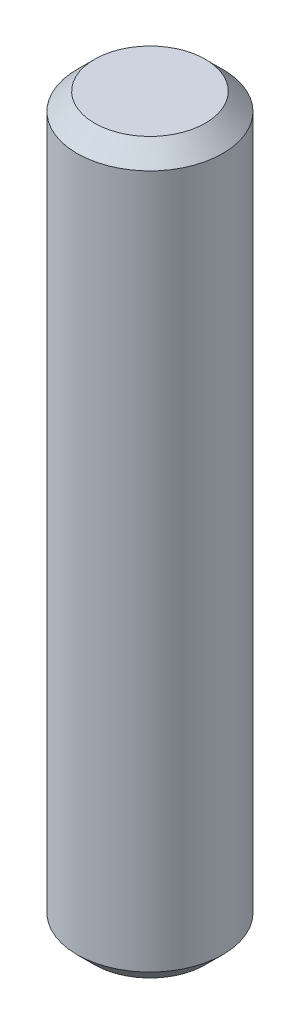
ISO-10303-21;
HEADER;
FILE_DESCRIPTION(('STEP AP214'),'2;1');
FILE_NAME('part.step','',(''),(''),'','','');
FILE_SCHEMA(('AUTOMOTIVE_DESIGN { 1 0 10303 214 1 1 1 1 }'));
ENDSEC;
DATA;
#1=APPLICATION_CONTEXT('core data for automotive mechanical design processes');
#2=APPLICATION_PROTOCOL_DEFINITION('international standard','automotive_design',2000,#1);
#3=PRODUCT_CONTEXT('',#1,'mechanical');
#4=PRODUCT('Part','Part','',(#3));
#5=PRODUCT_RELATED_PRODUCT_CATEGORY('part','',(#4));
#6=PRODUCT_DEFINITION_FORMATION('','',#4);
#7=PRODUCT_DEFINITION_CONTEXT('part definition',#1,'design');
#8=PRODUCT_DEFINITION('design','',#6,#7);
#9=PRODUCT_DEFINITION_SHAPE('','',#8);
#10=(LENGTH_UNIT() NAMED_UNIT(*) SI_UNIT(.MILLI.,.METRE.));
#11=(NAMED_UNIT(*) PLANE_ANGLE_UNIT() SI_UNIT($,.RADIAN.));
#12=(NAMED_UNIT(*) SI_UNIT($,.STERADIAN.) SOLID_ANGLE_UNIT());
#13=UNCERTAINTY_MEASURE_WITH_UNIT(LENGTH_MEASURE(1.E-05),#10,'distance_accuracy_value','');
#14=(GEOMETRIC_REPRESENTATION_CONTEXT(3) GLOBAL_UNCERTAINTY_ASSIGNED_CONTEXT((#13)) GLOBAL_UNIT_ASSIGNED_CONTEXT((#10,
#11,#12)) REPRESENTATION_CONTEXT('',''));
#15=CARTESIAN_POINT('',(0.,0.,0.));
#16=DIRECTION('',(0.,0.,1.));
#17=DIRECTION('',(1.,0.,0.));
#18=AXIS2_PLACEMENT_3D('',#15,#16,#17);
#19=CARTESIAN_POINT('',(0.,31.75,0.));
#20=DIRECTION('',(0.,-1.,0.));
#21=DIRECTION('',(0.,0.,-1.));
#22=AXIS2_PLACEMENT_3D('',#19,#20,#21);
#23=CYLINDRICAL_SURFACE('',#22,6.35);
#24=CARTESIAN_POINT('',(0.,-30.226,0.));
#25=DIRECTION('',(0.,1.,0.));
#26=DIRECTION('',(0.,0.,1.));
#27=AXIS2_PLACEMENT_3D('',#24,#25,#26);
#28=CIRCLE('',#27,6.35);
#29=CARTESIAN_POINT('',(0.,-30.226,6.35));
#30=VERTEX_POINT('',#29);
#31=EDGE_CURVE('E43',#30,#30,#28,.T.);
#32=ORIENTED_EDGE('',*,*,#31,.T.);
#33=EDGE_LOOP('',(#32));
#34=FACE_BOUND('',#33,.T.);
#35=CARTESIAN_POINT('',(0.,30.226,0.));
#36=DIRECTION('',(0.,1.,0.));
#37=DIRECTION('',(0.,0.,1.));
#38=AXIS2_PLACEMENT_3D('',#35,#36,#37);
#39=CIRCLE('',#38,6.35);
#40=CARTESIAN_POINT('',(0.,30.226,6.35));
#41=VERTEX_POINT('',#40);
#42=EDGE_CURVE('E47',#41,#41,#39,.F.);
#43=ORIENTED_EDGE('',*,*,#42,.T.);
#44=EDGE_LOOP('',(#43));
#45=FACE_BOUND('',#44,.T.);
#46=ADVANCED_FACE('F32',(#34,#45),#23,.T.);
#47=CARTESIAN_POINT('',(0.,31.75,0.));
#48=DIRECTION('',(0.,1.,0.));
#49=DIRECTION('',(0.,0.,1.));
#50=AXIS2_PLACEMENT_3D('',#47,#48,#49);
#51=PLANE('',#50);
#52=CARTESIAN_POINT('',(0.,31.75,0.));
#53=DIRECTION('',(0.,1.,0.));
#54=DIRECTION('',(0.,0.,1.));
#55=AXIS2_PLACEMENT_3D('',#52,#53,#54);
#56=CIRCLE('',#55,4.826);
#57=CARTESIAN_POINT('',(0.,31.75,4.826));
#58=VERTEX_POINT('',#57);
#59=EDGE_CURVE('E10',#58,#58,#56,.T.);
#60=ORIENTED_EDGE('',*,*,#59,.T.);
#61=EDGE_LOOP('',(#60));
#62=FACE_BOUND('',#61,.T.);
#63=ADVANCED_FACE('F63',(#62),#51,.T.);
#64=CARTESIAN_POINT('',(0.,-31.75,0.));
#65=DIRECTION('',(0.,1.,0.));
#66=DIRECTION('',(0.,0.,1.));
#67=AXIS2_PLACEMENT_3D('',#64,#65,#66);
#68=PLANE('',#67);
#69=CARTESIAN_POINT('',(0.,-31.75,0.));
#70=DIRECTION('',(0.,1.,0.));
#71=DIRECTION('',(0.,0.,1.));
#72=AXIS2_PLACEMENT_3D('',#69,#70,#71);
#73=CIRCLE('',#72,4.82599999999999);
#74=CARTESIAN_POINT('',(0.,-31.75,4.82599999999999));
#75=VERTEX_POINT('',#74);
#76=EDGE_CURVE('E39',#75,#75,#73,.F.);
#77=ORIENTED_EDGE('',*,*,#76,.T.);
#78=EDGE_LOOP('',(#77));
#79=FACE_BOUND('',#78,.T.);
#80=ADVANCED_FACE('F60',(#79),#68,.F.);
#81=CARTESIAN_POINT('',(0.,-30.226,0.));
#82=DIRECTION('',(0.,1.,0.));
#83=DIRECTION('',(0.,0.,1.));
#84=AXIS2_PLACEMENT_3D('',#81,#82,#83);
#85=CONICAL_SURFACE('',#84,6.35,0.785398163397452);
#86=ORIENTED_EDGE('',*,*,#76,.F.);
#87=EDGE_LOOP('',(#86));
#88=FACE_BOUND('',#87,.T.);
#89=ORIENTED_EDGE('',*,*,#31,.F.);
#90=EDGE_LOOP('',(#89));
#91=FACE_BOUND('',#90,.T.);
#92=ADVANCED_FACE('F56',(#88,#91),#85,.T.);
#93=CARTESIAN_POINT('',(0.,31.75,0.));
#94=DIRECTION('',(0.,-1.,0.));
#95=DIRECTION('',(0.,0.,-1.));
#96=AXIS2_PLACEMENT_3D('',#93,#94,#95);
#97=CONICAL_SURFACE('',#96,4.826,0.78539816339745);
#98=ORIENTED_EDGE('',*,*,#42,.F.);
#99=EDGE_LOOP('',(#98));
#100=FACE_BOUND('',#99,.T.);
#101=ORIENTED_EDGE('',*,*,#59,.F.);
#102=EDGE_LOOP('',(#101));
#103=FACE_BOUND('',#102,.T.);
#104=ADVANCED_FACE('F34',(#100,#103),#97,.T.);
#105=CLOSED_SHELL('',(#46,#63,#80,#92,#104));
#106=MANIFOLD_SOLID_BREP('B2',#105);
#107=ADVANCED_BREP_SHAPE_REPRESENTATION('',(#18,#106),#14);
#108=SHAPE_DEFINITION_REPRESENTATION(#9,#107);
ENDSEC;
END-ISO-10303-21;
